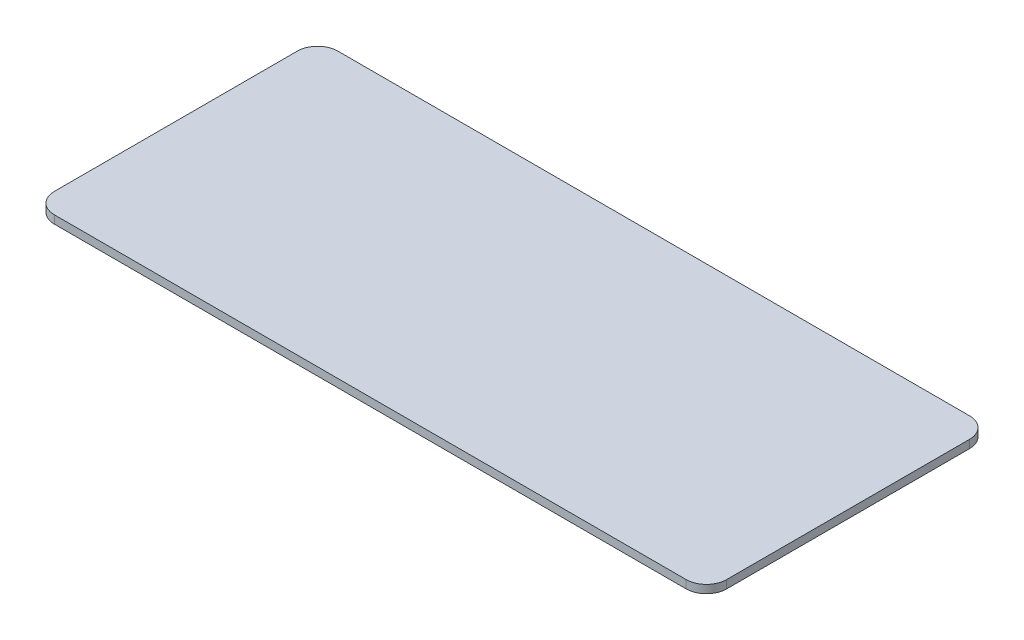
ISO-10303-21;
HEADER;
FILE_DESCRIPTION(('STEP AP214'),'2;1');
FILE_NAME('part.step','',(''),(''),'','','');
FILE_SCHEMA(('AUTOMOTIVE_DESIGN { 1 0 10303 214 1 1 1 1 }'));
ENDSEC;
DATA;
#1=APPLICATION_CONTEXT('core data for automotive mechanical design processes');
#2=APPLICATION_PROTOCOL_DEFINITION('international standard','automotive_design',2000,#1);
#3=PRODUCT_CONTEXT('',#1,'mechanical');
#4=PRODUCT('Part','Part','',(#3));
#5=PRODUCT_RELATED_PRODUCT_CATEGORY('part','',(#4));
#6=PRODUCT_DEFINITION_FORMATION('','',#4);
#7=PRODUCT_DEFINITION_CONTEXT('part definition',#1,'design');
#8=PRODUCT_DEFINITION('design','',#6,#7);
#9=PRODUCT_DEFINITION_SHAPE('','',#8);
#10=(LENGTH_UNIT() NAMED_UNIT(*) SI_UNIT(.MILLI.,.METRE.));
#11=(NAMED_UNIT(*) PLANE_ANGLE_UNIT() SI_UNIT($,.RADIAN.));
#12=(NAMED_UNIT(*) SI_UNIT($,.STERADIAN.) SOLID_ANGLE_UNIT());
#13=UNCERTAINTY_MEASURE_WITH_UNIT(LENGTH_MEASURE(1.E-05),#10,'distance_accuracy_value','');
#14=(GEOMETRIC_REPRESENTATION_CONTEXT(3) GLOBAL_UNCERTAINTY_ASSIGNED_CONTEXT((#13)) GLOBAL_UNIT_ASSIGNED_CONTEXT((#10,
#11,#12)) REPRESENTATION_CONTEXT('',''));
#15=CARTESIAN_POINT('',(0.,0.,0.));
#16=DIRECTION('',(0.,0.,1.));
#17=DIRECTION('',(1.,0.,0.));
#18=AXIS2_PLACEMENT_3D('',#15,#16,#17);
#19=CARTESIAN_POINT('',(0.,48.,0.));
#20=DIRECTION('',(0.,1.,0.));
#21=DIRECTION('',(0.,0.,1.));
#22=AXIS2_PLACEMENT_3D('',#19,#20,#21);
#23=PLANE('',#22);
#24=CARTESIAN_POINT('',(62.6371308016877,48.,-42.8481012658228));
#25=DIRECTION('',(0.,1.,0.));
#26=DIRECTION('',(0.,0.,1.));
#27=AXIS2_PLACEMENT_3D('',#24,#25,#26);
#28=CIRCLE('',#27,5.);
#29=CARTESIAN_POINT('',(62.6371308016877,48.,-47.8481012658228));
#30=VERTEX_POINT('',#29);
#31=CARTESIAN_POINT('',(67.6371308016878,48.,-42.8481012658228));
#32=VERTEX_POINT('',#31);
#33=EDGE_CURVE('E36',#30,#32,#28,.F.);
#34=ORIENTED_EDGE('',*,*,#33,.T.);
#35=DIRECTION('',(0.,0.,-1.));
#36=VECTOR('',#35,1.);
#37=CARTESIAN_POINT('',(67.6371308016878,48.,-47.8481012658228));
#38=LINE('',#37,#36);
#39=CARTESIAN_POINT('',(67.6371308016878,48.,17.1518987341772));
#40=VERTEX_POINT('',#39);
#41=EDGE_CURVE('E147',#40,#32,#38,.T.);
#42=ORIENTED_EDGE('',*,*,#41,.F.);
#43=CARTESIAN_POINT('',(62.6371308016878,48.,17.1518987341772));
#44=DIRECTION('',(0.,1.,0.));
#45=DIRECTION('',(0.,0.,1.));
#46=AXIS2_PLACEMENT_3D('',#43,#44,#45);
#47=CIRCLE('',#46,5.);
#48=CARTESIAN_POINT('',(62.6371308016878,48.,22.1518987341772));
#49=VERTEX_POINT('',#48);
#50=EDGE_CURVE('E41',#40,#49,#47,.F.);
#51=ORIENTED_EDGE('',*,*,#50,.T.);
#52=DIRECTION('',(1.,0.,0.));
#53=VECTOR('',#52,1.);
#54=CARTESIAN_POINT('',(-98.3544303797468,48.,22.1518987341772));
#55=LINE('',#54,#53);
#56=CARTESIAN_POINT('',(-93.3544303797468,48.,22.1518987341772));
#57=VERTEX_POINT('',#56);
#58=EDGE_CURVE('E145',#57,#49,#55,.T.);
#59=ORIENTED_EDGE('',*,*,#58,.F.);
#60=CARTESIAN_POINT('',(-93.3544303797468,48.,17.1518987341772));
#61=DIRECTION('',(0.,1.,0.));
#62=DIRECTION('',(0.,0.,1.));
#63=AXIS2_PLACEMENT_3D('',#60,#61,#62);
#64=CIRCLE('',#63,5.);
#65=CARTESIAN_POINT('',(-98.3544303797468,48.,17.1518987341772));
#66=VERTEX_POINT('',#65);
#67=EDGE_CURVE('E11',#57,#66,#64,.F.);
#68=ORIENTED_EDGE('',*,*,#67,.T.);
#69=DIRECTION('',(0.,0.,1.));
#70=VECTOR('',#69,1.);
#71=CARTESIAN_POINT('',(-98.3544303797468,48.,-47.8481012658228));
#72=LINE('',#71,#70);
#73=CARTESIAN_POINT('',(-98.3544303797468,48.,-42.8481012658228));
#74=VERTEX_POINT('',#73);
#75=EDGE_CURVE('E49',#74,#66,#72,.T.);
#76=ORIENTED_EDGE('',*,*,#75,.F.);
#77=CARTESIAN_POINT('',(-93.3544303797468,48.,-42.8481012658228));
#78=DIRECTION('',(0.,1.,0.));
#79=DIRECTION('',(0.,0.,1.));
#80=AXIS2_PLACEMENT_3D('',#77,#78,#79);
#81=CIRCLE('',#80,5.);
#82=CARTESIAN_POINT('',(-93.3544303797468,48.,-47.8481012658228));
#83=VERTEX_POINT('',#82);
#84=EDGE_CURVE('E120',#74,#83,#81,.F.);
#85=ORIENTED_EDGE('',*,*,#84,.T.);
#86=DIRECTION('',(-1.,0.,0.));
#87=VECTOR('',#86,1.);
#88=CARTESIAN_POINT('',(-98.3544303797468,48.,-47.8481012658228));
#89=LINE('',#88,#87);
#90=EDGE_CURVE('E143',#30,#83,#89,.T.);
#91=ORIENTED_EDGE('',*,*,#90,.F.);
#92=EDGE_LOOP('',(#34,#42,#51,#59,#68,#76,#85,#91));
#93=FACE_BOUND('',#92,.T.);
#94=ADVANCED_FACE('F33',(#93),#23,.F.);
#95=CARTESIAN_POINT('',(-98.3544303797468,50.,-47.8481012658228));
#96=DIRECTION('',(1.,0.,0.));
#97=DIRECTION('',(0.,0.,-1.));
#98=AXIS2_PLACEMENT_3D('',#95,#96,#97);
#99=PLANE('',#98);
#100=DIRECTION('',(0.,-1.,0.));
#101=VECTOR('',#100,1.);
#102=CARTESIAN_POINT('',(-98.3544303797468,50.,-42.8481012658228));
#103=LINE('',#102,#101);
#104=CARTESIAN_POINT('',(-98.3544303797468,50.,-42.8481012658228));
#105=VERTEX_POINT('',#104);
#106=EDGE_CURVE('E114',#105,#74,#103,.T.);
#107=ORIENTED_EDGE('',*,*,#106,.T.);
#108=ORIENTED_EDGE('',*,*,#75,.T.);
#109=DIRECTION('',(0.,-1.,0.));
#110=VECTOR('',#109,1.);
#111=CARTESIAN_POINT('',(-98.3544303797468,50.,17.1518987341772));
#112=LINE('',#111,#110);
#113=CARTESIAN_POINT('',(-98.3544303797468,50.,17.1518987341772));
#114=VERTEX_POINT('',#113);
#115=EDGE_CURVE('E115',#66,#114,#112,.F.);
#116=ORIENTED_EDGE('',*,*,#115,.T.);
#117=DIRECTION('',(0.,0.,1.));
#118=VECTOR('',#117,1.);
#119=CARTESIAN_POINT('',(-98.3544303797468,50.,-47.8481012658228));
#120=LINE('',#119,#118);
#121=EDGE_CURVE('E103',#105,#114,#120,.T.);
#122=ORIENTED_EDGE('',*,*,#121,.F.);
#123=EDGE_LOOP('',(#107,#108,#116,#122));
#124=FACE_BOUND('',#123,.T.);
#125=ADVANCED_FACE('F113',(#124),#99,.F.);
#126=CARTESIAN_POINT('',(0.,50.,0.));
#127=DIRECTION('',(0.,1.,0.));
#128=DIRECTION('',(0.,0.,1.));
#129=AXIS2_PLACEMENT_3D('',#126,#127,#128);
#130=PLANE('',#129);
#131=DIRECTION('',(-1.,0.,0.));
#132=VECTOR('',#131,1.);
#133=CARTESIAN_POINT('',(-98.3544303797468,50.,-47.8481012658228));
#134=LINE('',#133,#132);
#135=CARTESIAN_POINT('',(62.6371308016877,50.,-47.8481012658228));
#136=VERTEX_POINT('',#135);
#137=CARTESIAN_POINT('',(-93.3544303797468,50.,-47.8481012658228));
#138=VERTEX_POINT('',#137);
#139=EDGE_CURVE('E106',#136,#138,#134,.T.);
#140=ORIENTED_EDGE('',*,*,#139,.T.);
#141=CARTESIAN_POINT('',(-93.3544303797468,50.,-42.8481012658228));
#142=DIRECTION('',(0.,1.,0.));
#143=DIRECTION('',(0.,0.,1.));
#144=AXIS2_PLACEMENT_3D('',#141,#142,#143);
#145=CIRCLE('',#144,5.);
#146=EDGE_CURVE('E100',#138,#105,#145,.T.);
#147=ORIENTED_EDGE('',*,*,#146,.T.);
#148=ORIENTED_EDGE('',*,*,#121,.T.);
#149=CARTESIAN_POINT('',(-93.3544303797468,50.,17.1518987341772));
#150=DIRECTION('',(0.,1.,0.));
#151=DIRECTION('',(0.,0.,1.));
#152=AXIS2_PLACEMENT_3D('',#149,#150,#151);
#153=CIRCLE('',#152,5.);
#154=CARTESIAN_POINT('',(-93.3544303797468,50.,22.1518987341772));
#155=VERTEX_POINT('',#154);
#156=EDGE_CURVE('E130',#114,#155,#153,.T.);
#157=ORIENTED_EDGE('',*,*,#156,.T.);
#158=DIRECTION('',(1.,0.,0.));
#159=VECTOR('',#158,1.);
#160=CARTESIAN_POINT('',(-98.3544303797468,50.,22.1518987341772));
#161=LINE('',#160,#159);
#162=CARTESIAN_POINT('',(62.6371308016878,50.,22.1518987341772));
#163=VERTEX_POINT('',#162);
#164=EDGE_CURVE('E116',#155,#163,#161,.T.);
#165=ORIENTED_EDGE('',*,*,#164,.T.);
#166=CARTESIAN_POINT('',(62.6371308016878,50.,17.1518987341772));
#167=DIRECTION('',(0.,1.,0.));
#168=DIRECTION('',(0.,0.,1.));
#169=AXIS2_PLACEMENT_3D('',#166,#167,#168);
#170=CIRCLE('',#169,5.);
#171=CARTESIAN_POINT('',(67.6371308016878,50.,17.1518987341772));
#172=VERTEX_POINT('',#171);
#173=EDGE_CURVE('E132',#163,#172,#170,.T.);
#174=ORIENTED_EDGE('',*,*,#173,.T.);
#175=DIRECTION('',(0.,0.,-1.));
#176=VECTOR('',#175,1.);
#177=CARTESIAN_POINT('',(67.6371308016878,50.,-47.8481012658228));
#178=LINE('',#177,#176);
#179=CARTESIAN_POINT('',(67.6371308016878,50.,-42.8481012658228));
#180=VERTEX_POINT('',#179);
#181=EDGE_CURVE('E166',#172,#180,#178,.T.);
#182=ORIENTED_EDGE('',*,*,#181,.T.);
#183=CARTESIAN_POINT('',(62.6371308016877,50.,-42.8481012658228));
#184=DIRECTION('',(0.,1.,0.));
#185=DIRECTION('',(0.,0.,1.));
#186=AXIS2_PLACEMENT_3D('',#183,#184,#185);
#187=CIRCLE('',#186,5.);
#188=EDGE_CURVE('E111',#180,#136,#187,.T.);
#189=ORIENTED_EDGE('',*,*,#188,.T.);
#190=EDGE_LOOP('',(#140,#147,#148,#157,#165,#174,#182,#189));
#191=FACE_BOUND('',#190,.T.);
#192=ADVANCED_FACE('F102',(#191),#130,.T.);
#193=CARTESIAN_POINT('',(-98.3544303797468,50.,22.1518987341772));
#194=DIRECTION('',(0.,0.,-1.));
#195=DIRECTION('',(-1.,0.,0.));
#196=AXIS2_PLACEMENT_3D('',#193,#194,#195);
#197=PLANE('',#196);
#198=DIRECTION('',(0.,-1.,0.));
#199=VECTOR('',#198,1.);
#200=CARTESIAN_POINT('',(-93.3544303797468,50.,22.1518987341772));
#201=LINE('',#200,#199);
#202=EDGE_CURVE('E139',#155,#57,#201,.T.);
#203=ORIENTED_EDGE('',*,*,#202,.T.);
#204=ORIENTED_EDGE('',*,*,#58,.T.);
#205=DIRECTION('',(0.,-1.,0.));
#206=VECTOR('',#205,1.);
#207=CARTESIAN_POINT('',(62.6371308016878,50.,22.1518987341772));
#208=LINE('',#207,#206);
#209=EDGE_CURVE('E142',#49,#163,#208,.F.);
#210=ORIENTED_EDGE('',*,*,#209,.T.);
#211=ORIENTED_EDGE('',*,*,#164,.F.);
#212=EDGE_LOOP('',(#203,#204,#210,#211));
#213=FACE_BOUND('',#212,.T.);
#214=ADVANCED_FACE('F178',(#213),#197,.F.);
#215=CARTESIAN_POINT('',(-93.3544303797468,50.,17.1518987341772));
#216=DIRECTION('',(0.,-1.,0.));
#217=DIRECTION('',(0.,0.,-1.));
#218=AXIS2_PLACEMENT_3D('',#215,#216,#217);
#219=CYLINDRICAL_SURFACE('',#218,5.);
#220=ORIENTED_EDGE('',*,*,#67,.F.);
#221=ORIENTED_EDGE('',*,*,#202,.F.);
#222=ORIENTED_EDGE('',*,*,#156,.F.);
#223=ORIENTED_EDGE('',*,*,#115,.F.);
#224=EDGE_LOOP('',(#220,#221,#222,#223));
#225=FACE_BOUND('',#224,.T.);
#226=ADVANCED_FACE('F179',(#225),#219,.T.);
#227=CARTESIAN_POINT('',(67.6371308016878,50.,-47.8481012658228));
#228=DIRECTION('',(-1.,0.,0.));
#229=DIRECTION('',(0.,0.,1.));
#230=AXIS2_PLACEMENT_3D('',#227,#228,#229);
#231=PLANE('',#230);
#232=DIRECTION('',(0.,-1.,0.));
#233=VECTOR('',#232,1.);
#234=CARTESIAN_POINT('',(67.6371308016878,50.,17.1518987341772));
#235=LINE('',#234,#233);
#236=EDGE_CURVE('E110',#172,#40,#235,.T.);
#237=ORIENTED_EDGE('',*,*,#236,.T.);
#238=ORIENTED_EDGE('',*,*,#41,.T.);
#239=DIRECTION('',(0.,-1.,0.));
#240=VECTOR('',#239,1.);
#241=CARTESIAN_POINT('',(67.6371308016878,50.,-42.8481012658228));
#242=LINE('',#241,#240);
#243=EDGE_CURVE('E137',#32,#180,#242,.F.);
#244=ORIENTED_EDGE('',*,*,#243,.T.);
#245=ORIENTED_EDGE('',*,*,#181,.F.);
#246=EDGE_LOOP('',(#237,#238,#244,#245));
#247=FACE_BOUND('',#246,.T.);
#248=ADVANCED_FACE('F155',(#247),#231,.F.);
#249=CARTESIAN_POINT('',(62.6371308016878,50.,17.1518987341772));
#250=DIRECTION('',(0.,-1.,0.));
#251=DIRECTION('',(0.,0.,-1.));
#252=AXIS2_PLACEMENT_3D('',#249,#250,#251);
#253=CYLINDRICAL_SURFACE('',#252,5.);
#254=ORIENTED_EDGE('',*,*,#50,.F.);
#255=ORIENTED_EDGE('',*,*,#236,.F.);
#256=ORIENTED_EDGE('',*,*,#173,.F.);
#257=ORIENTED_EDGE('',*,*,#209,.F.);
#258=EDGE_LOOP('',(#254,#255,#256,#257));
#259=FACE_BOUND('',#258,.T.);
#260=ADVANCED_FACE('F177',(#259),#253,.T.);
#261=CARTESIAN_POINT('',(-98.3544303797468,50.,-47.8481012658228));
#262=DIRECTION('',(0.,0.,1.));
#263=DIRECTION('',(1.,0.,0.));
#264=AXIS2_PLACEMENT_3D('',#261,#262,#263);
#265=PLANE('',#264);
#266=DIRECTION('',(0.,-1.,0.));
#267=VECTOR('',#266,1.);
#268=CARTESIAN_POINT('',(62.6371308016877,50.,-47.8481012658228));
#269=LINE('',#268,#267);
#270=EDGE_CURVE('E121',#136,#30,#269,.T.);
#271=ORIENTED_EDGE('',*,*,#270,.T.);
#272=ORIENTED_EDGE('',*,*,#90,.T.);
#273=DIRECTION('',(0.,-1.,0.));
#274=VECTOR('',#273,1.);
#275=CARTESIAN_POINT('',(-93.3544303797468,50.,-47.8481012658228));
#276=LINE('',#275,#274);
#277=EDGE_CURVE('E124',#83,#138,#276,.F.);
#278=ORIENTED_EDGE('',*,*,#277,.T.);
#279=ORIENTED_EDGE('',*,*,#139,.F.);
#280=EDGE_LOOP('',(#271,#272,#278,#279));
#281=FACE_BOUND('',#280,.T.);
#282=ADVANCED_FACE('F168',(#281),#265,.F.);
#283=CARTESIAN_POINT('',(62.6371308016877,50.,-42.8481012658228));
#284=DIRECTION('',(0.,-1.,0.));
#285=DIRECTION('',(0.,0.,-1.));
#286=AXIS2_PLACEMENT_3D('',#283,#284,#285);
#287=CYLINDRICAL_SURFACE('',#286,5.);
#288=ORIENTED_EDGE('',*,*,#33,.F.);
#289=ORIENTED_EDGE('',*,*,#270,.F.);
#290=ORIENTED_EDGE('',*,*,#188,.F.);
#291=ORIENTED_EDGE('',*,*,#243,.F.);
#292=EDGE_LOOP('',(#288,#289,#290,#291));
#293=FACE_BOUND('',#292,.T.);
#294=ADVANCED_FACE('F165',(#293),#287,.T.);
#295=CARTESIAN_POINT('',(-93.3544303797468,50.,-42.8481012658228));
#296=DIRECTION('',(0.,-1.,0.));
#297=DIRECTION('',(0.,0.,-1.));
#298=AXIS2_PLACEMENT_3D('',#295,#296,#297);
#299=CYLINDRICAL_SURFACE('',#298,5.);
#300=ORIENTED_EDGE('',*,*,#84,.F.);
#301=ORIENTED_EDGE('',*,*,#106,.F.);
#302=ORIENTED_EDGE('',*,*,#146,.F.);
#303=ORIENTED_EDGE('',*,*,#277,.F.);
#304=EDGE_LOOP('',(#300,#301,#302,#303));
#305=FACE_BOUND('',#304,.T.);
#306=ADVANCED_FACE('F118',(#305),#299,.T.);
#307=CLOSED_SHELL('',(#94,#125,#192,#214,#226,#248,#260,#282,#294,#306));
#308=MANIFOLD_SOLID_BREP('B2',#307);
#309=ADVANCED_BREP_SHAPE_REPRESENTATION('',(#18,#308),#14);
#310=SHAPE_DEFINITION_REPRESENTATION(#9,#309);
ENDSEC;
END-ISO-10303-21;
